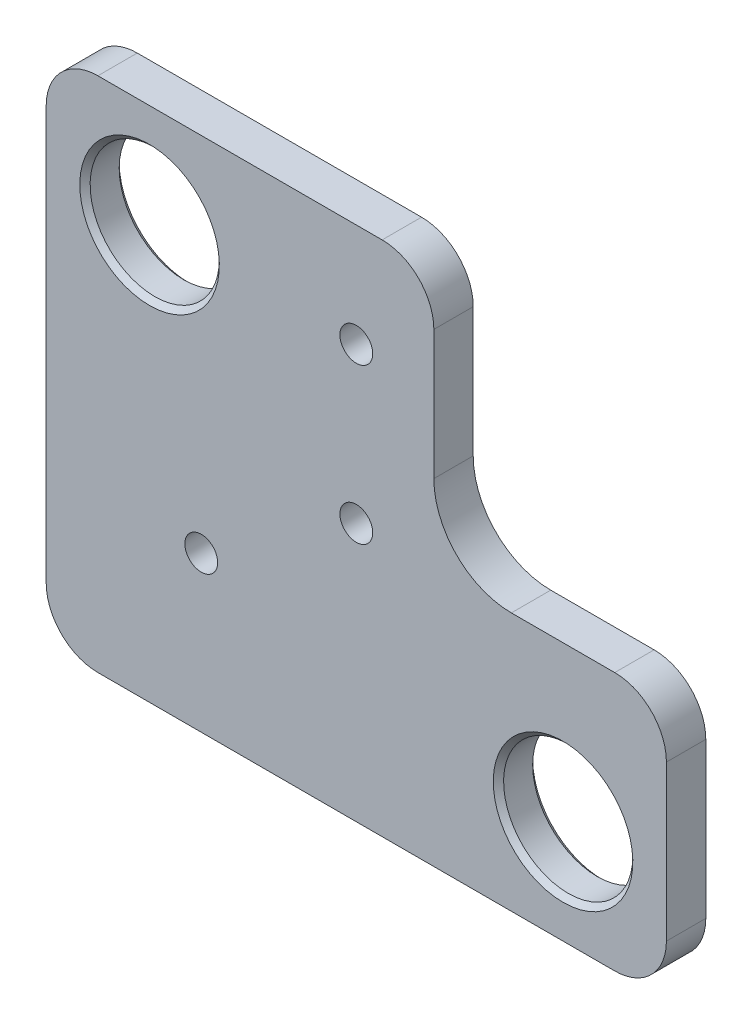
ISO-10303-21;
HEADER;
FILE_DESCRIPTION(('STEP AP214'),'2;1');
FILE_NAME('part.step','',(''),(''),'','','');
FILE_SCHEMA(('AUTOMOTIVE_DESIGN { 1 0 10303 214 1 1 1 1 }'));
ENDSEC;
DATA;
#1=APPLICATION_CONTEXT('core data for automotive mechanical design processes');
#2=APPLICATION_PROTOCOL_DEFINITION('international standard','automotive_design',2000,#1);
#3=PRODUCT_CONTEXT('',#1,'mechanical');
#4=PRODUCT('Part','Part','',(#3));
#5=PRODUCT_RELATED_PRODUCT_CATEGORY('part','',(#4));
#6=PRODUCT_DEFINITION_FORMATION('','',#4);
#7=PRODUCT_DEFINITION_CONTEXT('part definition',#1,'design');
#8=PRODUCT_DEFINITION('design','',#6,#7);
#9=PRODUCT_DEFINITION_SHAPE('','',#8);
#10=(LENGTH_UNIT() NAMED_UNIT(*) SI_UNIT(.MILLI.,.METRE.));
#11=(NAMED_UNIT(*) PLANE_ANGLE_UNIT() SI_UNIT($,.RADIAN.));
#12=(NAMED_UNIT(*) SI_UNIT($,.STERADIAN.) SOLID_ANGLE_UNIT());
#13=UNCERTAINTY_MEASURE_WITH_UNIT(LENGTH_MEASURE(1.E-05),#10,'distance_accuracy_value','');
#14=(GEOMETRIC_REPRESENTATION_CONTEXT(3) GLOBAL_UNCERTAINTY_ASSIGNED_CONTEXT((#13)) GLOBAL_UNIT_ASSIGNED_CONTEXT((#10,
#11,#12)) REPRESENTATION_CONTEXT('',''));
#15=CARTESIAN_POINT('',(0.,0.,0.));
#16=DIRECTION('',(0.,0.,1.));
#17=DIRECTION('',(1.,0.,0.));
#18=AXIS2_PLACEMENT_3D('',#15,#16,#17);
#19=CARTESIAN_POINT('',(10.,-8.,0.1));
#20=DIRECTION('',(0.,0.,-1.));
#21=DIRECTION('',(-1.,0.,0.));
#22=AXIS2_PLACEMENT_3D('',#19,#20,#21);
#23=CONICAL_SURFACE('',#22,1.25,0.785398163397454);
#24=CARTESIAN_POINT('',(10.,-8.,0.));
#25=DIRECTION('',(0.,0.,-1.));
#26=DIRECTION('',(-1.,0.,0.));
#27=AXIS2_PLACEMENT_3D('',#24,#25,#26);
#28=CIRCLE('',#27,1.35);
#29=CARTESIAN_POINT('',(8.65,-8.,0.));
#30=VERTEX_POINT('',#29);
#31=EDGE_CURVE('E21',#30,#30,#28,.T.);
#32=ORIENTED_EDGE('',*,*,#31,.T.);
#33=EDGE_LOOP('',(#32));
#34=FACE_BOUND('',#33,.T.);
#35=CARTESIAN_POINT('',(10.,-8.,0.1));
#36=DIRECTION('',(0.,0.,1.));
#37=DIRECTION('',(1.,0.,0.));
#38=AXIS2_PLACEMENT_3D('',#35,#36,#37);
#39=CIRCLE('',#38,1.25);
#40=CARTESIAN_POINT('',(11.25,-8.,0.1));
#41=VERTEX_POINT('',#40);
#42=EDGE_CURVE('E138',#41,#41,#39,.F.);
#43=ORIENTED_EDGE('',*,*,#42,.F.);
#44=EDGE_LOOP('',(#43));
#45=FACE_BOUND('',#44,.T.);
#46=ADVANCED_FACE('F17',(#34,#45),#23,.F.);
#47=CARTESIAN_POINT('',(10.,-8.,0.1));
#48=DIRECTION('',(0.,0.,1.));
#49=DIRECTION('',(1.,0.,0.));
#50=AXIS2_PLACEMENT_3D('',#47,#48,#49);
#51=CYLINDRICAL_SURFACE('',#50,1.25);
#52=ORIENTED_EDGE('',*,*,#42,.T.);
#53=EDGE_LOOP('',(#52));
#54=FACE_BOUND('',#53,.T.);
#55=CARTESIAN_POINT('',(10.,-8.,0.662000000000051));
#56=DIRECTION('',(0.,0.,1.));
#57=DIRECTION('',(1.,0.,0.));
#58=AXIS2_PLACEMENT_3D('',#55,#56,#57);
#59=CIRCLE('',#58,1.25);
#60=CARTESIAN_POINT('',(11.25,-8.,0.662));
#61=VERTEX_POINT('',#60);
#62=EDGE_CURVE('E186',#61,#61,#59,.F.);
#63=ORIENTED_EDGE('',*,*,#62,.F.);
#64=EDGE_LOOP('',(#63));
#65=FACE_BOUND('',#64,.T.);
#66=ADVANCED_FACE('F465',(#54,#65),#51,.F.);
#67=CARTESIAN_POINT('',(0.,-10.,0.));
#68=DIRECTION('',(0.,0.,1.));
#69=DIRECTION('',(1.,0.,0.));
#70=AXIS2_PLACEMENT_3D('',#67,#68,#69);
#71=PLANE('',#70);
#72=CARTESIAN_POINT('',(6.,-5.,0.));
#73=DIRECTION('',(0.,0.,1.));
#74=DIRECTION('',(1.,0.,0.));
#75=AXIS2_PLACEMENT_3D('',#72,#73,#74);
#76=CIRCLE('',#75,0.317499999999999);
#77=CARTESIAN_POINT('',(6.3175,-5.,0.));
#78=VERTEX_POINT('',#77);
#79=EDGE_CURVE('E177',#78,#78,#76,.F.);
#80=ORIENTED_EDGE('',*,*,#79,.F.);
#81=EDGE_LOOP('',(#80));
#82=FACE_BOUND('',#81,.T.);
#83=CARTESIAN_POINT('',(6.,-2.,0.));
#84=DIRECTION('',(0.,0.,1.));
#85=DIRECTION('',(1.,0.,0.));
#86=AXIS2_PLACEMENT_3D('',#83,#84,#85);
#87=CIRCLE('',#86,0.317499999999999);
#88=CARTESIAN_POINT('',(6.3175,-2.,0.));
#89=VERTEX_POINT('',#88);
#90=EDGE_CURVE('E180',#89,#89,#87,.F.);
#91=ORIENTED_EDGE('',*,*,#90,.F.);
#92=EDGE_LOOP('',(#91));
#93=FACE_BOUND('',#92,.T.);
#94=CARTESIAN_POINT('',(3.,-7.,0.));
#95=DIRECTION('',(0.,0.,1.));
#96=DIRECTION('',(1.,0.,0.));
#97=AXIS2_PLACEMENT_3D('',#94,#95,#96);
#98=CIRCLE('',#97,0.3175);
#99=CARTESIAN_POINT('',(3.3175,-7.,0.));
#100=VERTEX_POINT('',#99);
#101=EDGE_CURVE('E183',#100,#100,#98,.F.);
#102=ORIENTED_EDGE('',*,*,#101,.F.);
#103=EDGE_LOOP('',(#102));
#104=FACE_BOUND('',#103,.T.);
#105=ORIENTED_EDGE('',*,*,#31,.F.);
#106=EDGE_LOOP('',(#105));
#107=FACE_BOUND('',#106,.T.);
#108=CARTESIAN_POINT('',(2.,-2.,0.));
#109=DIRECTION('',(0.,0.,-1.));
#110=DIRECTION('',(-1.,0.,0.));
#111=AXIS2_PLACEMENT_3D('',#108,#109,#110);
#112=CIRCLE('',#111,1.35);
#113=CARTESIAN_POINT('',(0.65,-2.,0.));
#114=VERTEX_POINT('',#113);
#115=EDGE_CURVE('E120',#114,#114,#112,.T.);
#116=ORIENTED_EDGE('',*,*,#115,.F.);
#117=EDGE_LOOP('',(#116));
#118=FACE_BOUND('',#117,.T.);
#119=CARTESIAN_POINT('',(11.,-6.,0.));
#120=DIRECTION('',(0.,0.,-1.));
#121=DIRECTION('',(0.,1.,0.));
#122=AXIS2_PLACEMENT_3D('',#119,#120,#121);
#123=CIRCLE('',#122,0.999999999999999);
#124=CARTESIAN_POINT('',(11.,-5.,0.));
#125=VERTEX_POINT('',#124);
#126=CARTESIAN_POINT('',(12.,-6.0000000002051,0.));
#127=VERTEX_POINT('',#126);
#128=EDGE_CURVE('E105',#125,#127,#123,.T.);
#129=ORIENTED_EDGE('',*,*,#128,.T.);
#130=DIRECTION('',(0.,-1.,0.));
#131=VECTOR('',#130,1.);
#132=CARTESIAN_POINT('',(12.,-7.5,0.));
#133=LINE('',#132,#131);
#134=CARTESIAN_POINT('',(12.,-9.0000000002051,0.));
#135=VERTEX_POINT('',#134);
#136=EDGE_CURVE('E111',#127,#135,#133,.T.);
#137=ORIENTED_EDGE('',*,*,#136,.T.);
#138=CARTESIAN_POINT('',(11.,-9.,0.));
#139=DIRECTION('',(0.,0.,-1.));
#140=DIRECTION('',(0.,1.,0.));
#141=AXIS2_PLACEMENT_3D('',#138,#139,#140);
#142=CIRCLE('',#141,0.999999999999999);
#143=CARTESIAN_POINT('',(11.0000000001923,-10.,0.));
#144=VERTEX_POINT('',#143);
#145=EDGE_CURVE('E187',#135,#144,#142,.T.);
#146=ORIENTED_EDGE('',*,*,#145,.T.);
#147=DIRECTION('',(-1.,0.,0.));
#148=VECTOR('',#147,1.);
#149=CARTESIAN_POINT('',(6.,-10.,0.));
#150=LINE('',#149,#148);
#151=CARTESIAN_POINT('',(1.,-10.,0.));
#152=VERTEX_POINT('',#151);
#153=EDGE_CURVE('E226',#144,#152,#150,.T.);
#154=ORIENTED_EDGE('',*,*,#153,.T.);
#155=CARTESIAN_POINT('',(1.,-9.,0.));
#156=DIRECTION('',(0.,0.,-1.));
#157=DIRECTION('',(0.,1.,0.));
#158=AXIS2_PLACEMENT_3D('',#155,#156,#157);
#159=CIRCLE('',#158,1.);
#160=CARTESIAN_POINT('',(0.,-9.00000000008979,0.));
#161=VERTEX_POINT('',#160);
#162=EDGE_CURVE('E190',#152,#161,#159,.T.);
#163=ORIENTED_EDGE('',*,*,#162,.T.);
#164=DIRECTION('',(0.,1.,0.));
#165=VECTOR('',#164,1.);
#166=CARTESIAN_POINT('',(0.,-5.,0.));
#167=LINE('',#166,#165);
#168=CARTESIAN_POINT('',(0.,-1.,0.));
#169=VERTEX_POINT('',#168);
#170=EDGE_CURVE('E230',#161,#169,#167,.T.);
#171=ORIENTED_EDGE('',*,*,#170,.T.);
#172=CARTESIAN_POINT('',(1.,-1.,0.));
#173=DIRECTION('',(0.,0.,-1.));
#174=DIRECTION('',(0.,1.,0.));
#175=AXIS2_PLACEMENT_3D('',#172,#173,#174);
#176=CIRCLE('',#175,1.);
#177=CARTESIAN_POINT('',(1.00000000010255,0.,0.));
#178=VERTEX_POINT('',#177);
#179=EDGE_CURVE('E195',#169,#178,#176,.T.);
#180=ORIENTED_EDGE('',*,*,#179,.T.);
#181=DIRECTION('',(1.,0.,0.));
#182=VECTOR('',#181,1.);
#183=CARTESIAN_POINT('',(3.75,0.,0.));
#184=LINE('',#183,#182);
#185=CARTESIAN_POINT('',(6.5,0.,0.));
#186=VERTEX_POINT('',#185);
#187=EDGE_CURVE('E206',#178,#186,#184,.T.);
#188=ORIENTED_EDGE('',*,*,#187,.T.);
#189=CARTESIAN_POINT('',(6.5,-1.,0.));
#190=DIRECTION('',(0.,0.,-1.));
#191=DIRECTION('',(0.,1.,0.));
#192=AXIS2_PLACEMENT_3D('',#189,#190,#191);
#193=CIRCLE('',#192,1.);
#194=CARTESIAN_POINT('',(7.5,-1.0000000002051,0.));
#195=VERTEX_POINT('',#194);
#196=EDGE_CURVE('E199',#186,#195,#193,.T.);
#197=ORIENTED_EDGE('',*,*,#196,.T.);
#198=DIRECTION('',(0.,-1.,0.));
#199=VECTOR('',#198,1.);
#200=CARTESIAN_POINT('',(7.5,-2.25,0.));
#201=LINE('',#200,#199);
#202=CARTESIAN_POINT('',(7.5,-3.5,0.));
#203=VERTEX_POINT('',#202);
#204=EDGE_CURVE('E209',#195,#203,#201,.T.);
#205=ORIENTED_EDGE('',*,*,#204,.T.);
#206=CARTESIAN_POINT('',(9.,-3.5,0.));
#207=DIRECTION('',(0.,0.,1.));
#208=DIRECTION('',(1.,0.,0.));
#209=AXIS2_PLACEMENT_3D('',#206,#207,#208);
#210=CIRCLE('',#209,1.5);
#211=CARTESIAN_POINT('',(8.99999999971148,-5.,0.));
#212=VERTEX_POINT('',#211);
#213=EDGE_CURVE('E132',#212,#203,#210,.F.);
#214=ORIENTED_EDGE('',*,*,#213,.F.);
#215=DIRECTION('',(1.,0.,0.));
#216=VECTOR('',#215,1.);
#217=CARTESIAN_POINT('',(10.,-5.,0.));
#218=LINE('',#217,#216);
#219=EDGE_CURVE('E129',#212,#125,#218,.T.);
#220=ORIENTED_EDGE('',*,*,#219,.T.);
#221=EDGE_LOOP('',(#129,#137,#146,#154,#163,#171,#180,#188,#197,#205,#214,#220));
#222=FACE_BOUND('',#221,.T.);
#223=ADVANCED_FACE('F127',(#82,#93,#104,#107,#118,#222),#71,.F.);
#224=CARTESIAN_POINT('',(2.,-2.,0.1));
#225=DIRECTION('',(0.,0.,-1.));
#226=DIRECTION('',(-1.,0.,0.));
#227=AXIS2_PLACEMENT_3D('',#224,#225,#226);
#228=CONICAL_SURFACE('',#227,1.25,0.785398163397449);
#229=CARTESIAN_POINT('',(2.,-2.,0.1));
#230=DIRECTION('',(0.,0.,1.));
#231=DIRECTION('',(1.,0.,0.));
#232=AXIS2_PLACEMENT_3D('',#229,#230,#231);
#233=CIRCLE('',#232,1.25);
#234=CARTESIAN_POINT('',(3.25,-2.,0.1));
#235=VERTEX_POINT('',#234);
#236=EDGE_CURVE('E146',#235,#235,#233,.F.);
#237=ORIENTED_EDGE('',*,*,#236,.F.);
#238=EDGE_LOOP('',(#237));
#239=FACE_BOUND('',#238,.T.);
#240=ORIENTED_EDGE('',*,*,#115,.T.);
#241=EDGE_LOOP('',(#240));
#242=FACE_BOUND('',#241,.T.);
#243=ADVANCED_FACE('F449',(#239,#242),#228,.F.);
#244=CARTESIAN_POINT('',(12.,-6.,0.));
#245=DIRECTION('',(-1.,0.,0.));
#246=DIRECTION('',(0.,-1.,0.));
#247=AXIS2_PLACEMENT_3D('',#244,#245,#246);
#248=PLANE('',#247);
#249=DIRECTION('',(0.,0.,-1.));
#250=VECTOR('',#249,1.);
#251=CARTESIAN_POINT('',(12.,-6.00000000041021,0.381));
#252=LINE('',#251,#250);
#253=CARTESIAN_POINT('',(12.,-6.0000000002051,0.762));
#254=VERTEX_POINT('',#253);
#255=EDGE_CURVE('E114',#127,#254,#252,.F.);
#256=ORIENTED_EDGE('',*,*,#255,.T.);
#257=DIRECTION('',(0.,1.,0.));
#258=VECTOR('',#257,1.);
#259=CARTESIAN_POINT('',(12.,-5.,0.762));
#260=LINE('',#259,#258);
#261=CARTESIAN_POINT('',(12.,-9.0000000002051,0.762));
#262=VERTEX_POINT('',#261);
#263=EDGE_CURVE('E176',#262,#254,#260,.T.);
#264=ORIENTED_EDGE('',*,*,#263,.F.);
#265=DIRECTION('',(0.,0.,1.));
#266=VECTOR('',#265,1.);
#267=CARTESIAN_POINT('',(12.,-9.00000000041021,0.381));
#268=LINE('',#267,#266);
#269=EDGE_CURVE('E116',#262,#135,#268,.F.);
#270=ORIENTED_EDGE('',*,*,#269,.T.);
#271=ORIENTED_EDGE('',*,*,#136,.F.);
#272=EDGE_LOOP('',(#256,#264,#270,#271));
#273=FACE_BOUND('',#272,.T.);
#274=ADVANCED_FACE('F112',(#273),#248,.F.);
#275=CARTESIAN_POINT('',(11.,-6.,0.762));
#276=DIRECTION('',(0.,0.,-1.));
#277=DIRECTION('',(0.,1.,0.));
#278=AXIS2_PLACEMENT_3D('',#275,#276,#277);
#279=CYLINDRICAL_SURFACE('',#278,0.999999999999999);
#280=ORIENTED_EDGE('',*,*,#255,.F.);
#281=ORIENTED_EDGE('',*,*,#128,.F.);
#282=DIRECTION('',(0.,0.,1.));
#283=VECTOR('',#282,1.);
#284=CARTESIAN_POINT('',(11.,-5.,0.381));
#285=LINE('',#284,#283);
#286=CARTESIAN_POINT('',(11.,-5.,0.762));
#287=VERTEX_POINT('',#286);
#288=EDGE_CURVE('E124',#125,#287,#285,.T.);
#289=ORIENTED_EDGE('',*,*,#288,.T.);
#290=CARTESIAN_POINT('',(11.,-6.,0.762));
#291=DIRECTION('',(0.,0.,-1.));
#292=DIRECTION('',(0.,1.,0.));
#293=AXIS2_PLACEMENT_3D('',#290,#291,#292);
#294=CIRCLE('',#293,0.999999999999999);
#295=EDGE_CURVE('E123',#254,#287,#294,.F.);
#296=ORIENTED_EDGE('',*,*,#295,.F.);
#297=EDGE_LOOP('',(#280,#281,#289,#296));
#298=FACE_BOUND('',#297,.T.);
#299=ADVANCED_FACE('F122',(#298),#279,.T.);
#300=CARTESIAN_POINT('',(9.,-5.,0.));
#301=DIRECTION('',(0.,-1.,0.));
#302=DIRECTION('',(1.,0.,0.));
#303=AXIS2_PLACEMENT_3D('',#300,#301,#302);
#304=PLANE('',#303);
#305=DIRECTION('',(0.,0.,1.));
#306=VECTOR('',#305,1.);
#307=CARTESIAN_POINT('',(8.99999999942297,-5.,0.381));
#308=LINE('',#307,#306);
#309=CARTESIAN_POINT('',(8.99999999971148,-5.,0.762));
#310=VERTEX_POINT('',#309);
#311=EDGE_CURVE('E218',#310,#212,#308,.F.);
#312=ORIENTED_EDGE('',*,*,#311,.F.);
#313=DIRECTION('',(-1.,0.,0.));
#314=VECTOR('',#313,1.);
#315=CARTESIAN_POINT('',(6.,-5.,0.762));
#316=LINE('',#315,#314);
#317=EDGE_CURVE('E174',#287,#310,#316,.T.);
#318=ORIENTED_EDGE('',*,*,#317,.F.);
#319=ORIENTED_EDGE('',*,*,#288,.F.);
#320=ORIENTED_EDGE('',*,*,#219,.F.);
#321=EDGE_LOOP('',(#312,#318,#319,#320));
#322=FACE_BOUND('',#321,.T.);
#323=ADVANCED_FACE('F273',(#322),#304,.F.);
#324=CARTESIAN_POINT('',(9.,-3.5,0.));
#325=DIRECTION('',(0.,0.,1.));
#326=DIRECTION('',(1.,0.,0.));
#327=AXIS2_PLACEMENT_3D('',#324,#325,#326);
#328=CYLINDRICAL_SURFACE('',#327,1.5);
#329=ORIENTED_EDGE('',*,*,#213,.T.);
#330=DIRECTION('',(0.,0.,1.));
#331=VECTOR('',#330,1.);
#332=CARTESIAN_POINT('',(7.5,-3.5,0.381));
#333=LINE('',#332,#331);
#334=CARTESIAN_POINT('',(7.5,-3.5,0.762));
#335=VERTEX_POINT('',#334);
#336=EDGE_CURVE('E202',#203,#335,#333,.T.);
#337=ORIENTED_EDGE('',*,*,#336,.T.);
#338=CARTESIAN_POINT('',(9.,-3.5,0.762));
#339=DIRECTION('',(0.,0.,1.));
#340=DIRECTION('',(1.,0.,0.));
#341=AXIS2_PLACEMENT_3D('',#338,#339,#340);
#342=CIRCLE('',#341,1.5);
#343=EDGE_CURVE('E172',#310,#335,#342,.F.);
#344=ORIENTED_EDGE('',*,*,#343,.F.);
#345=ORIENTED_EDGE('',*,*,#311,.T.);
#346=EDGE_LOOP('',(#329,#337,#344,#345));
#347=FACE_BOUND('',#346,.T.);
#348=ADVANCED_FACE('F274',(#347),#328,.F.);
#349=CARTESIAN_POINT('',(7.5,-3.5,0.));
#350=DIRECTION('',(-1.,0.,0.));
#351=DIRECTION('',(0.,0.,1.));
#352=AXIS2_PLACEMENT_3D('',#349,#350,#351);
#353=PLANE('',#352);
#354=ORIENTED_EDGE('',*,*,#336,.F.);
#355=ORIENTED_EDGE('',*,*,#204,.F.);
#356=DIRECTION('',(0.,0.,-1.));
#357=VECTOR('',#356,1.);
#358=CARTESIAN_POINT('',(7.5,-1.00000000041021,0.381));
#359=LINE('',#358,#357);
#360=CARTESIAN_POINT('',(7.5,-1.0000000002051,0.762));
#361=VERTEX_POINT('',#360);
#362=EDGE_CURVE('E201',#195,#361,#359,.F.);
#363=ORIENTED_EDGE('',*,*,#362,.T.);
#364=DIRECTION('',(0.,1.,0.));
#365=VECTOR('',#364,1.);
#366=CARTESIAN_POINT('',(7.5,-5.,0.762));
#367=LINE('',#366,#365);
#368=EDGE_CURVE('E171',#335,#361,#367,.T.);
#369=ORIENTED_EDGE('',*,*,#368,.F.);
#370=EDGE_LOOP('',(#354,#355,#363,#369));
#371=FACE_BOUND('',#370,.T.);
#372=ADVANCED_FACE('F277',(#371),#353,.F.);
#373=CARTESIAN_POINT('',(6.5,-1.,0.762));
#374=DIRECTION('',(0.,0.,-1.));
#375=DIRECTION('',(0.,1.,0.));
#376=AXIS2_PLACEMENT_3D('',#373,#374,#375);
#377=CYLINDRICAL_SURFACE('',#376,1.);
#378=ORIENTED_EDGE('',*,*,#362,.F.);
#379=ORIENTED_EDGE('',*,*,#196,.F.);
#380=DIRECTION('',(0.,0.,1.));
#381=VECTOR('',#380,1.);
#382=CARTESIAN_POINT('',(6.5,0.,0.381));
#383=LINE('',#382,#381);
#384=CARTESIAN_POINT('',(6.5,0.,0.762));
#385=VERTEX_POINT('',#384);
#386=EDGE_CURVE('E198',#186,#385,#383,.T.);
#387=ORIENTED_EDGE('',*,*,#386,.T.);
#388=CARTESIAN_POINT('',(6.5,-1.,0.762));
#389=DIRECTION('',(0.,0.,-1.));
#390=DIRECTION('',(0.,1.,0.));
#391=AXIS2_PLACEMENT_3D('',#388,#389,#390);
#392=CIRCLE('',#391,1.);
#393=EDGE_CURVE('E169',#361,#385,#392,.F.);
#394=ORIENTED_EDGE('',*,*,#393,.F.);
#395=EDGE_LOOP('',(#378,#379,#387,#394));
#396=FACE_BOUND('',#395,.T.);
#397=ADVANCED_FACE('F278',(#396),#377,.T.);
#398=CARTESIAN_POINT('',(1.,0.,0.762));
#399=DIRECTION('',(0.,-1.,0.));
#400=DIRECTION('',(0.,0.,-1.));
#401=AXIS2_PLACEMENT_3D('',#398,#399,#400);
#402=PLANE('',#401);
#403=ORIENTED_EDGE('',*,*,#386,.F.);
#404=ORIENTED_EDGE('',*,*,#187,.F.);
#405=DIRECTION('',(0.,0.,-1.));
#406=VECTOR('',#405,1.);
#407=CARTESIAN_POINT('',(1.0000000002051,0.,0.381));
#408=LINE('',#407,#406);
#409=CARTESIAN_POINT('',(1.00000000010255,0.,0.762));
#410=VERTEX_POINT('',#409);
#411=EDGE_CURVE('E197',#178,#410,#408,.F.);
#412=ORIENTED_EDGE('',*,*,#411,.T.);
#413=DIRECTION('',(-1.,0.,0.));
#414=VECTOR('',#413,1.);
#415=CARTESIAN_POINT('',(6.,0.,0.762));
#416=LINE('',#415,#414);
#417=EDGE_CURVE('E168',#385,#410,#416,.T.);
#418=ORIENTED_EDGE('',*,*,#417,.F.);
#419=EDGE_LOOP('',(#403,#404,#412,#418));
#420=FACE_BOUND('',#419,.T.);
#421=ADVANCED_FACE('F280',(#420),#402,.F.);
#422=CARTESIAN_POINT('',(1.,-1.,0.762));
#423=DIRECTION('',(0.,0.,-1.));
#424=DIRECTION('',(0.,1.,0.));
#425=AXIS2_PLACEMENT_3D('',#422,#423,#424);
#426=CYLINDRICAL_SURFACE('',#425,1.);
#427=ORIENTED_EDGE('',*,*,#411,.F.);
#428=ORIENTED_EDGE('',*,*,#179,.F.);
#429=DIRECTION('',(0.,0.,1.));
#430=VECTOR('',#429,1.);
#431=CARTESIAN_POINT('',(0.,-1.,0.381));
#432=LINE('',#431,#430);
#433=CARTESIAN_POINT('',(0.,-1.,0.762));
#434=VERTEX_POINT('',#433);
#435=EDGE_CURVE('E194',#169,#434,#432,.T.);
#436=ORIENTED_EDGE('',*,*,#435,.T.);
#437=CARTESIAN_POINT('',(1.,-1.,0.762));
#438=DIRECTION('',(0.,0.,-1.));
#439=DIRECTION('',(0.,1.,0.));
#440=AXIS2_PLACEMENT_3D('',#437,#438,#439);
#441=CIRCLE('',#440,1.);
#442=EDGE_CURVE('E166',#410,#434,#441,.F.);
#443=ORIENTED_EDGE('',*,*,#442,.F.);
#444=EDGE_LOOP('',(#427,#428,#436,#443));
#445=FACE_BOUND('',#444,.T.);
#446=ADVANCED_FACE('F287',(#445),#426,.T.);
#447=CARTESIAN_POINT('',(0.,-9.,0.));
#448=DIRECTION('',(1.,0.,0.));
#449=DIRECTION('',(0.,1.,0.));
#450=AXIS2_PLACEMENT_3D('',#447,#448,#449);
#451=PLANE('',#450);
#452=ORIENTED_EDGE('',*,*,#435,.F.);
#453=ORIENTED_EDGE('',*,*,#170,.F.);
#454=DIRECTION('',(0.,0.,-1.));
#455=VECTOR('',#454,1.);
#456=CARTESIAN_POINT('',(0.,-9.00000000017959,0.381));
#457=LINE('',#456,#455);
#458=CARTESIAN_POINT('',(0.,-9.00000000008979,0.762));
#459=VERTEX_POINT('',#458);
#460=EDGE_CURVE('E193',#161,#459,#457,.F.);
#461=ORIENTED_EDGE('',*,*,#460,.T.);
#462=DIRECTION('',(0.,-1.,0.));
#463=VECTOR('',#462,1.);
#464=CARTESIAN_POINT('',(0.,-5.,0.762));
#465=LINE('',#464,#463);
#466=EDGE_CURVE('E165',#434,#459,#465,.T.);
#467=ORIENTED_EDGE('',*,*,#466,.F.);
#468=EDGE_LOOP('',(#452,#453,#461,#467));
#469=FACE_BOUND('',#468,.T.);
#470=ADVANCED_FACE('F260',(#469),#451,.F.);
#471=CARTESIAN_POINT('',(1.,-9.,0.762));
#472=DIRECTION('',(0.,0.,-1.));
#473=DIRECTION('',(0.,1.,0.));
#474=AXIS2_PLACEMENT_3D('',#471,#472,#473);
#475=CYLINDRICAL_SURFACE('',#474,1.);
#476=ORIENTED_EDGE('',*,*,#460,.F.);
#477=ORIENTED_EDGE('',*,*,#162,.F.);
#478=DIRECTION('',(0.,0.,1.));
#479=VECTOR('',#478,1.);
#480=CARTESIAN_POINT('',(1.,-10.,0.381));
#481=LINE('',#480,#479);
#482=CARTESIAN_POINT('',(1.,-10.,0.762));
#483=VERTEX_POINT('',#482);
#484=EDGE_CURVE('E228',#152,#483,#481,.T.);
#485=ORIENTED_EDGE('',*,*,#484,.T.);
#486=CARTESIAN_POINT('',(1.,-9.,0.762));
#487=DIRECTION('',(0.,0.,-1.));
#488=DIRECTION('',(0.,1.,0.));
#489=AXIS2_PLACEMENT_3D('',#486,#487,#488);
#490=CIRCLE('',#489,1.);
#491=EDGE_CURVE('E163',#459,#483,#490,.F.);
#492=ORIENTED_EDGE('',*,*,#491,.F.);
#493=EDGE_LOOP('',(#476,#477,#485,#492));
#494=FACE_BOUND('',#493,.T.);
#495=ADVANCED_FACE('F262',(#494),#475,.T.);
#496=CARTESIAN_POINT('',(11.,-10.,0.));
#497=DIRECTION('',(0.,1.,0.));
#498=DIRECTION('',(-1.,0.,0.));
#499=AXIS2_PLACEMENT_3D('',#496,#497,#498);
#500=PLANE('',#499);
#501=ORIENTED_EDGE('',*,*,#484,.F.);
#502=ORIENTED_EDGE('',*,*,#153,.F.);
#503=DIRECTION('',(0.,0.,-1.));
#504=VECTOR('',#503,1.);
#505=CARTESIAN_POINT('',(11.0000000003847,-10.,0.381));
#506=LINE('',#505,#504);
#507=CARTESIAN_POINT('',(11.0000000001923,-10.,0.762));
#508=VERTEX_POINT('',#507);
#509=EDGE_CURVE('E189',#144,#508,#506,.F.);
#510=ORIENTED_EDGE('',*,*,#509,.T.);
#511=DIRECTION('',(1.,0.,0.));
#512=VECTOR('',#511,1.);
#513=CARTESIAN_POINT('',(6.,-10.,0.762));
#514=LINE('',#513,#512);
#515=EDGE_CURVE('E36',#483,#508,#514,.T.);
#516=ORIENTED_EDGE('',*,*,#515,.F.);
#517=EDGE_LOOP('',(#501,#502,#510,#516));
#518=FACE_BOUND('',#517,.T.);
#519=ADVANCED_FACE('F265',(#518),#500,.F.);
#520=CARTESIAN_POINT('',(11.,-9.,0.762));
#521=DIRECTION('',(0.,0.,-1.));
#522=DIRECTION('',(0.,1.,0.));
#523=AXIS2_PLACEMENT_3D('',#520,#521,#522);
#524=CYLINDRICAL_SURFACE('',#523,0.999999999999999);
#525=ORIENTED_EDGE('',*,*,#509,.F.);
#526=ORIENTED_EDGE('',*,*,#145,.F.);
#527=ORIENTED_EDGE('',*,*,#269,.F.);
#528=CARTESIAN_POINT('',(11.,-9.,0.762));
#529=DIRECTION('',(0.,0.,-1.));
#530=DIRECTION('',(0.,1.,0.));
#531=AXIS2_PLACEMENT_3D('',#528,#529,#530);
#532=CIRCLE('',#531,0.999999999999999);
#533=EDGE_CURVE('E161',#508,#262,#532,.F.);
#534=ORIENTED_EDGE('',*,*,#533,.F.);
#535=EDGE_LOOP('',(#525,#526,#527,#534));
#536=FACE_BOUND('',#535,.T.);
#537=ADVANCED_FACE('F269',(#536),#524,.T.);
#538=CARTESIAN_POINT('',(10.,-8.,0.662));
#539=DIRECTION('',(0.,0.,1.));
#540=DIRECTION('',(0.,-1.,0.));
#541=AXIS2_PLACEMENT_3D('',#538,#539,#540);
#542=CONICAL_SURFACE('',#541,1.25,0.785398163397463);
#543=ORIENTED_EDGE('',*,*,#62,.T.);
#544=EDGE_LOOP('',(#543));
#545=FACE_BOUND('',#544,.T.);
#546=CARTESIAN_POINT('',(10.,-8.,0.76200000000004));
#547=DIRECTION('',(0.,0.,1.));
#548=DIRECTION('',(0.,-1.,0.));
#549=AXIS2_PLACEMENT_3D('',#546,#547,#548);
#550=CIRCLE('',#549,1.35000000000004);
#551=CARTESIAN_POINT('',(10.,-9.35000000000004,0.76200000000004));
#552=VERTEX_POINT('',#551);
#553=EDGE_CURVE('E158',#552,#552,#550,.F.);
#554=ORIENTED_EDGE('',*,*,#553,.F.);
#555=EDGE_LOOP('',(#554));
#556=FACE_BOUND('',#555,.T.);
#557=ADVANCED_FACE('F318',(#545,#556),#542,.F.);
#558=CARTESIAN_POINT('',(3.,-7.,0.));
#559=DIRECTION('',(0.,0.,1.));
#560=DIRECTION('',(1.,0.,0.));
#561=AXIS2_PLACEMENT_3D('',#558,#559,#560);
#562=CYLINDRICAL_SURFACE('',#561,0.3175);
#563=CARTESIAN_POINT('',(3.,-7.,0.762));
#564=DIRECTION('',(0.,0.,1.));
#565=DIRECTION('',(1.,0.,0.));
#566=AXIS2_PLACEMENT_3D('',#563,#564,#565);
#567=CIRCLE('',#566,0.3175);
#568=CARTESIAN_POINT('',(3.3175,-7.,0.762));
#569=VERTEX_POINT('',#568);
#570=EDGE_CURVE('E155',#569,#569,#567,.F.);
#571=ORIENTED_EDGE('',*,*,#570,.F.);
#572=EDGE_LOOP('',(#571));
#573=FACE_BOUND('',#572,.T.);
#574=ORIENTED_EDGE('',*,*,#101,.T.);
#575=EDGE_LOOP('',(#574));
#576=FACE_BOUND('',#575,.T.);
#577=ADVANCED_FACE('F314',(#573,#576),#562,.F.);
#578=CARTESIAN_POINT('',(6.,-2.,0.));
#579=DIRECTION('',(0.,0.,1.));
#580=DIRECTION('',(1.,0.,0.));
#581=AXIS2_PLACEMENT_3D('',#578,#579,#580);
#582=CYLINDRICAL_SURFACE('',#581,0.317499999999999);
#583=CARTESIAN_POINT('',(6.,-2.,0.762));
#584=DIRECTION('',(0.,0.,1.));
#585=DIRECTION('',(1.,0.,0.));
#586=AXIS2_PLACEMENT_3D('',#583,#584,#585);
#587=CIRCLE('',#586,0.317499999999999);
#588=CARTESIAN_POINT('',(6.3175,-2.,0.762));
#589=VERTEX_POINT('',#588);
#590=EDGE_CURVE('E152',#589,#589,#587,.F.);
#591=ORIENTED_EDGE('',*,*,#590,.F.);
#592=EDGE_LOOP('',(#591));
#593=FACE_BOUND('',#592,.T.);
#594=ORIENTED_EDGE('',*,*,#90,.T.);
#595=EDGE_LOOP('',(#594));
#596=FACE_BOUND('',#595,.T.);
#597=ADVANCED_FACE('F310',(#593,#596),#582,.F.);
#598=CARTESIAN_POINT('',(6.,-5.,0.));
#599=DIRECTION('',(0.,0.,1.));
#600=DIRECTION('',(1.,0.,0.));
#601=AXIS2_PLACEMENT_3D('',#598,#599,#600);
#602=CYLINDRICAL_SURFACE('',#601,0.317499999999999);
#603=CARTESIAN_POINT('',(6.,-5.,0.762));
#604=DIRECTION('',(0.,0.,1.));
#605=DIRECTION('',(1.,0.,0.));
#606=AXIS2_PLACEMENT_3D('',#603,#604,#605);
#607=CIRCLE('',#606,0.317499999999999);
#608=CARTESIAN_POINT('',(6.3175,-5.,0.762));
#609=VERTEX_POINT('',#608);
#610=EDGE_CURVE('E149',#609,#609,#607,.F.);
#611=ORIENTED_EDGE('',*,*,#610,.F.);
#612=EDGE_LOOP('',(#611));
#613=FACE_BOUND('',#612,.T.);
#614=ORIENTED_EDGE('',*,*,#79,.T.);
#615=EDGE_LOOP('',(#614));
#616=FACE_BOUND('',#615,.T.);
#617=ADVANCED_FACE('F306',(#613,#616),#602,.F.);
#618=CARTESIAN_POINT('',(2.,-2.,0.1));
#619=DIRECTION('',(0.,0.,1.));
#620=DIRECTION('',(1.,0.,0.));
#621=AXIS2_PLACEMENT_3D('',#618,#619,#620);
#622=CYLINDRICAL_SURFACE('',#621,1.25);
#623=ORIENTED_EDGE('',*,*,#236,.T.);
#624=EDGE_LOOP('',(#623));
#625=FACE_BOUND('',#624,.T.);
#626=CARTESIAN_POINT('',(2.,-2.,0.662000000000051));
#627=DIRECTION('',(0.,0.,1.));
#628=DIRECTION('',(1.,0.,0.));
#629=AXIS2_PLACEMENT_3D('',#626,#627,#628);
#630=CIRCLE('',#629,1.25);
#631=CARTESIAN_POINT('',(3.25,-2.,0.662));
#632=VERTEX_POINT('',#631);
#633=EDGE_CURVE('E27',#632,#632,#630,.F.);
#634=ORIENTED_EDGE('',*,*,#633,.F.);
#635=EDGE_LOOP('',(#634));
#636=FACE_BOUND('',#635,.T.);
#637=ADVANCED_FACE('F300',(#625,#636),#622,.F.);
#638=CARTESIAN_POINT('',(0.,-10.,0.762));
#639=DIRECTION('',(0.,0.,1.));
#640=DIRECTION('',(1.,0.,0.));
#641=AXIS2_PLACEMENT_3D('',#638,#639,#640);
#642=PLANE('',#641);
#643=ORIENTED_EDGE('',*,*,#610,.T.);
#644=EDGE_LOOP('',(#643));
#645=FACE_BOUND('',#644,.T.);
#646=ORIENTED_EDGE('',*,*,#590,.T.);
#647=EDGE_LOOP('',(#646));
#648=FACE_BOUND('',#647,.T.);
#649=ORIENTED_EDGE('',*,*,#570,.T.);
#650=EDGE_LOOP('',(#649));
#651=FACE_BOUND('',#650,.T.);
#652=CARTESIAN_POINT('',(2.,-2.,0.76200000000004));
#653=DIRECTION('',(0.,0.,1.));
#654=DIRECTION('',(0.,-1.,0.));
#655=AXIS2_PLACEMENT_3D('',#652,#653,#654);
#656=CIRCLE('',#655,1.35000000000004);
#657=CARTESIAN_POINT('',(2.,-3.35000000000004,0.762000000000041));
#658=VERTEX_POINT('',#657);
#659=EDGE_CURVE('E11',#658,#658,#656,.T.);
#660=ORIENTED_EDGE('',*,*,#659,.F.);
#661=EDGE_LOOP('',(#660));
#662=FACE_BOUND('',#661,.T.);
#663=ORIENTED_EDGE('',*,*,#553,.T.);
#664=EDGE_LOOP('',(#663));
#665=FACE_BOUND('',#664,.T.);
#666=ORIENTED_EDGE('',*,*,#515,.T.);
#667=ORIENTED_EDGE('',*,*,#533,.T.);
#668=ORIENTED_EDGE('',*,*,#263,.T.);
#669=ORIENTED_EDGE('',*,*,#295,.T.);
#670=ORIENTED_EDGE('',*,*,#317,.T.);
#671=ORIENTED_EDGE('',*,*,#343,.T.);
#672=ORIENTED_EDGE('',*,*,#368,.T.);
#673=ORIENTED_EDGE('',*,*,#393,.T.);
#674=ORIENTED_EDGE('',*,*,#417,.T.);
#675=ORIENTED_EDGE('',*,*,#442,.T.);
#676=ORIENTED_EDGE('',*,*,#466,.T.);
#677=ORIENTED_EDGE('',*,*,#491,.T.);
#678=EDGE_LOOP('',(#666,#667,#668,#669,#670,#671,#672,#673,#674,#675,#676,#677));
#679=FACE_BOUND('',#678,.T.);
#680=ADVANCED_FACE('F19',(#645,#648,#651,#662,#665,#679),#642,.T.);
#681=CARTESIAN_POINT('',(2.,-2.,0.662));
#682=DIRECTION('',(0.,0.,1.));
#683=DIRECTION('',(0.,-1.,0.));
#684=AXIS2_PLACEMENT_3D('',#681,#682,#683);
#685=CONICAL_SURFACE('',#684,1.25,0.785398163397446);
#686=ORIENTED_EDGE('',*,*,#633,.T.);
#687=EDGE_LOOP('',(#686));
#688=FACE_BOUND('',#687,.T.);
#689=ORIENTED_EDGE('',*,*,#659,.T.);
#690=EDGE_LOOP('',(#689));
#691=FACE_BOUND('',#690,.T.);
#692=ADVANCED_FACE('F293',(#688,#691),#685,.F.);
#693=CLOSED_SHELL('',(#46,#66,#223,#243,#274,#299,#323,#348,#372,#397,#421,#446,#470,#495,#519,
#537,#557,#577,#597,#617,#637,#680,#692));
#694=MANIFOLD_SOLID_BREP('B1',#693);
#695=ADVANCED_BREP_SHAPE_REPRESENTATION('',(#18,#694),#14);
#696=SHAPE_DEFINITION_REPRESENTATION(#9,#695);
ENDSEC;
END-ISO-10303-21;
